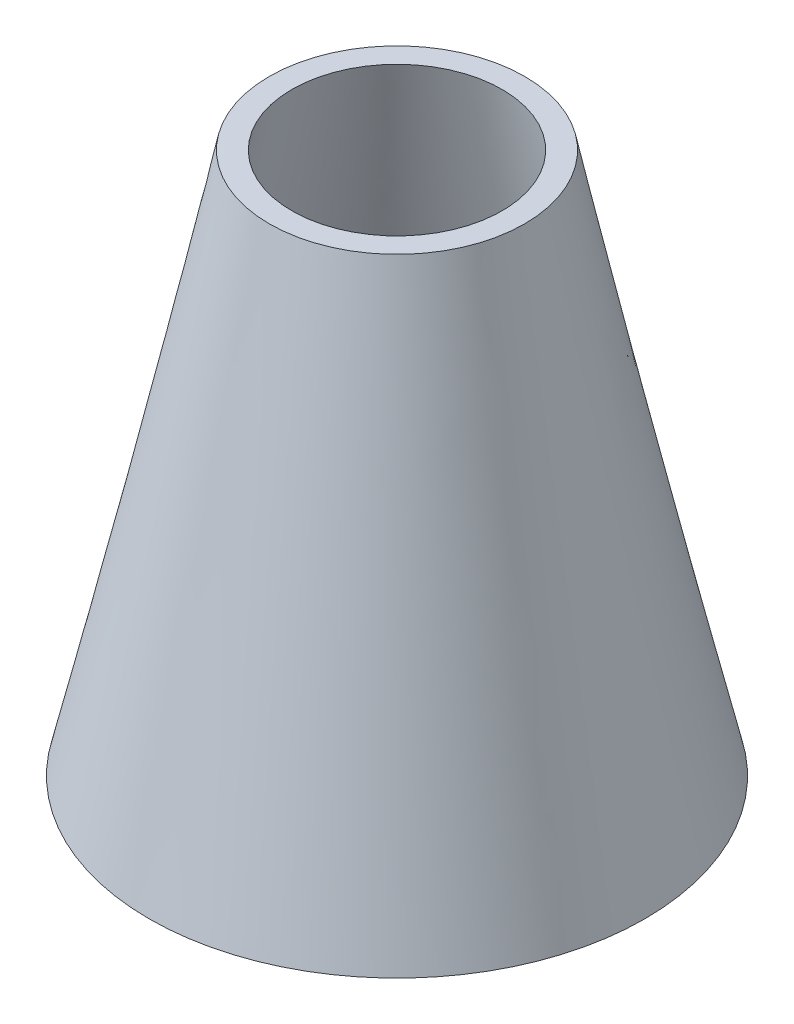
ISO-10303-21;
HEADER;
FILE_DESCRIPTION(('STEP AP214'),'2;1');
FILE_NAME('part.step','',(''),(''),'','','');
FILE_SCHEMA(('AUTOMOTIVE_DESIGN { 1 0 10303 214 1 1 1 1 }'));
ENDSEC;
DATA;
#1=APPLICATION_CONTEXT('core data for automotive mechanical design processes');
#2=APPLICATION_PROTOCOL_DEFINITION('international standard','automotive_design',2000,#1);
#3=PRODUCT_CONTEXT('',#1,'mechanical');
#4=PRODUCT('Part','Part','',(#3));
#5=PRODUCT_RELATED_PRODUCT_CATEGORY('part','',(#4));
#6=PRODUCT_DEFINITION_FORMATION('','',#4);
#7=PRODUCT_DEFINITION_CONTEXT('part definition',#1,'design');
#8=PRODUCT_DEFINITION('design','',#6,#7);
#9=PRODUCT_DEFINITION_SHAPE('','',#8);
#10=(LENGTH_UNIT() NAMED_UNIT(*) SI_UNIT(.MILLI.,.METRE.));
#11=(NAMED_UNIT(*) PLANE_ANGLE_UNIT() SI_UNIT($,.RADIAN.));
#12=(NAMED_UNIT(*) SI_UNIT($,.STERADIAN.) SOLID_ANGLE_UNIT());
#13=UNCERTAINTY_MEASURE_WITH_UNIT(LENGTH_MEASURE(1.E-05),#10,'distance_accuracy_value','');
#14=(GEOMETRIC_REPRESENTATION_CONTEXT(3) GLOBAL_UNCERTAINTY_ASSIGNED_CONTEXT((#13)) GLOBAL_UNIT_ASSIGNED_CONTEXT((#10,
#11,#12)) REPRESENTATION_CONTEXT('',''));
#15=CARTESIAN_POINT('',(0.,0.,0.));
#16=DIRECTION('',(0.,0.,1.));
#17=DIRECTION('',(1.,0.,0.));
#18=AXIS2_PLACEMENT_3D('',#15,#16,#17);
#19=CARTESIAN_POINT('',(35.,98.4039462195902,0.));
#20=CARTESIAN_POINT('',(53.9092305461905,7.99673999986837,0.));
#21=CARTESIAN_POINT('',(74.9992765745929,-81.9254673316333,0.));
#22=B_SPLINE_CURVE_WITH_KNOTS('',2,(#19,#20,#21),.UNSPECIFIED.,.F.,.F.,(3,3),(0.,1.),.UNSPECIFIED.);
#23=CARTESIAN_POINT('',(0.,105.448040776767,0.));
#24=DIRECTION('',(0.,1.,0.));
#25=AXIS1_PLACEMENT('',#23,#24);
#26=SURFACE_OF_REVOLUTION('',#22,#25);
#27=CARTESIAN_POINT('',(0.,-81.9254673316333,0.));
#28=DIRECTION('',(0.,1.,0.));
#29=DIRECTION('',(-1.,0.,0.));
#30=AXIS2_PLACEMENT_3D('',#27,#28,#29);
#31=CIRCLE('',#30,74.9992765745929);
#32=CARTESIAN_POINT('',(-74.9992765745928,-81.9254673316333,0.));
#33=VERTEX_POINT('',#32);
#34=EDGE_CURVE('E50',#33,#33,#31,.T.);
#35=ORIENTED_EDGE('',*,*,#34,.F.);
#36=EDGE_LOOP('',(#35));
#37=FACE_BOUND('',#36,.T.);
#38=CARTESIAN_POINT('',(0.,98.4039462195902,0.));
#39=DIRECTION('',(0.,1.,0.));
#40=DIRECTION('',(-1.,0.,0.));
#41=AXIS2_PLACEMENT_3D('',#38,#39,#40);
#42=CIRCLE('',#41,35.);
#43=CARTESIAN_POINT('',(-35.,98.4039462195902,0.));
#44=VERTEX_POINT('',#43);
#45=EDGE_CURVE('E10',#44,#44,#42,.T.);
#46=ORIENTED_EDGE('',*,*,#45,.T.);
#47=EDGE_LOOP('',(#46));
#48=FACE_BOUND('',#47,.T.);
#49=ADVANCED_FACE('F35',(#37,#48),#26,.T.);
#50=CARTESIAN_POINT('',(35.,98.4039462195902,0.));
#51=DIRECTION('',(0.,-1.,0.));
#52=DIRECTION('',(1.,0.,0.));
#53=AXIS2_PLACEMENT_3D('',#50,#51,#52);
#54=PLANE('',#53);
#55=ORIENTED_EDGE('',*,*,#45,.F.);
#56=EDGE_LOOP('',(#55));
#57=FACE_BOUND('',#56,.T.);
#58=CARTESIAN_POINT('',(0.,98.4039462195902,0.));
#59=DIRECTION('',(0.,1.,0.));
#60=DIRECTION('',(-1.,0.,0.));
#61=AXIS2_PLACEMENT_3D('',#58,#59,#60);
#62=CIRCLE('',#61,42.5);
#63=CARTESIAN_POINT('',(-42.5,98.4039462195902,0.));
#64=VERTEX_POINT('',#63);
#65=EDGE_CURVE('E42',#64,#64,#62,.T.);
#66=ORIENTED_EDGE('',*,*,#65,.T.);
#67=EDGE_LOOP('',(#66));
#68=FACE_BOUND('',#67,.T.);
#69=ADVANCED_FACE('F69',(#57,#68),#54,.F.);
#70=CARTESIAN_POINT('',(82.4992765745929,-81.9254673316333,0.));
#71=CARTESIAN_POINT('',(61.4092305461905,7.99673999986838,0.));
#72=CARTESIAN_POINT('',(42.5,98.4039462195902,0.));
#73=B_SPLINE_CURVE_WITH_KNOTS('',2,(#70,#71,#72),.UNSPECIFIED.,.F.,.F.,(3,3),(0.,1.),.UNSPECIFIED.);
#74=CARTESIAN_POINT('',(0.,105.448040776767,0.));
#75=DIRECTION('',(0.,1.,0.));
#76=AXIS1_PLACEMENT('',#74,#75);
#77=SURFACE_OF_REVOLUTION('',#73,#76);
#78=ORIENTED_EDGE('',*,*,#65,.F.);
#79=EDGE_LOOP('',(#78));
#80=FACE_BOUND('',#79,.T.);
#81=CARTESIAN_POINT('',(0.,-81.9254673316333,0.));
#82=DIRECTION('',(0.,1.,0.));
#83=DIRECTION('',(-1.,0.,0.));
#84=AXIS2_PLACEMENT_3D('',#81,#82,#83);
#85=CIRCLE('',#84,82.4992765745928);
#86=CARTESIAN_POINT('',(-82.4992765745928,-81.9254673316333,0.));
#87=VERTEX_POINT('',#86);
#88=EDGE_CURVE('E46',#87,#87,#85,.T.);
#89=ORIENTED_EDGE('',*,*,#88,.T.);
#90=EDGE_LOOP('',(#89));
#91=FACE_BOUND('',#90,.T.);
#92=ADVANCED_FACE('F65',(#80,#91),#77,.T.);
#93=CARTESIAN_POINT('',(74.9992765745929,-81.9254673316333,0.));
#94=DIRECTION('',(0.,1.,0.));
#95=DIRECTION('',(-1.,0.,0.));
#96=AXIS2_PLACEMENT_3D('',#93,#94,#95);
#97=PLANE('',#96);
#98=ORIENTED_EDGE('',*,*,#88,.F.);
#99=EDGE_LOOP('',(#98));
#100=FACE_BOUND('',#99,.T.);
#101=ORIENTED_EDGE('',*,*,#34,.T.);
#102=EDGE_LOOP('',(#101));
#103=FACE_BOUND('',#102,.T.);
#104=ADVANCED_FACE('F68',(#100,#103),#97,.F.);
#105=CLOSED_SHELL('',(#49,#69,#92,#104));
#106=MANIFOLD_SOLID_BREP('B2',#105);
#107=ADVANCED_BREP_SHAPE_REPRESENTATION('',(#18,#106),#14);
#108=SHAPE_DEFINITION_REPRESENTATION(#9,#107);
ENDSEC;
END-ISO-10303-21;
